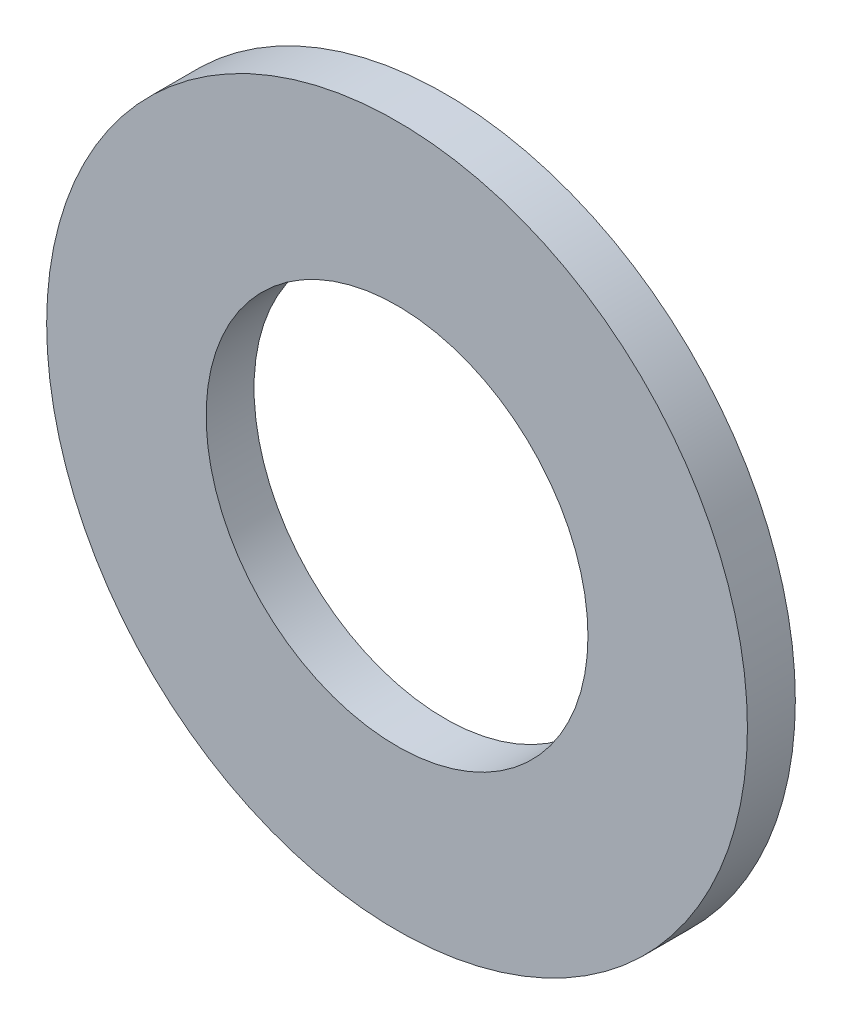
ISO-10303-21;
HEADER;
FILE_DESCRIPTION(('STEP AP214'),'2;1');
FILE_NAME('part.step','',(''),(''),'','','');
FILE_SCHEMA(('AUTOMOTIVE_DESIGN { 1 0 10303 214 1 1 1 1 }'));
ENDSEC;
DATA;
#1=APPLICATION_CONTEXT('core data for automotive mechanical design processes');
#2=APPLICATION_PROTOCOL_DEFINITION('international standard','automotive_design',2000,#1);
#3=PRODUCT_CONTEXT('',#1,'mechanical');
#4=PRODUCT('Part','Part','',(#3));
#5=PRODUCT_RELATED_PRODUCT_CATEGORY('part','',(#4));
#6=PRODUCT_DEFINITION_FORMATION('','',#4);
#7=PRODUCT_DEFINITION_CONTEXT('part definition',#1,'design');
#8=PRODUCT_DEFINITION('design','',#6,#7);
#9=PRODUCT_DEFINITION_SHAPE('','',#8);
#10=(LENGTH_UNIT() NAMED_UNIT(*) SI_UNIT(.MILLI.,.METRE.));
#11=(NAMED_UNIT(*) PLANE_ANGLE_UNIT() SI_UNIT($,.RADIAN.));
#12=(NAMED_UNIT(*) SI_UNIT($,.STERADIAN.) SOLID_ANGLE_UNIT());
#13=UNCERTAINTY_MEASURE_WITH_UNIT(LENGTH_MEASURE(1.E-05),#10,'distance_accuracy_value','');
#14=(GEOMETRIC_REPRESENTATION_CONTEXT(3) GLOBAL_UNCERTAINTY_ASSIGNED_CONTEXT((#13)) GLOBAL_UNIT_ASSIGNED_CONTEXT((#10,
#11,#12)) REPRESENTATION_CONTEXT('',''));
#15=CARTESIAN_POINT('',(0.,0.,0.));
#16=DIRECTION('',(0.,0.,1.));
#17=DIRECTION('',(1.,0.,0.));
#18=AXIS2_PLACEMENT_3D('',#15,#16,#17);
#19=CARTESIAN_POINT('',(0.,0.,0.4064));
#20=DIRECTION('',(0.,0.,1.));
#21=DIRECTION('',(1.,0.,0.));
#22=AXIS2_PLACEMENT_3D('',#19,#20,#21);
#23=PLANE('',#22);
#24=CARTESIAN_POINT('',(0.,0.,0.4064));
#25=DIRECTION('',(0.,0.,1.));
#26=DIRECTION('',(1.,0.,0.));
#27=AXIS2_PLACEMENT_3D('',#24,#25,#26);
#28=CIRCLE('',#27,5.9436);
#29=CARTESIAN_POINT('',(5.9436,0.,0.4064));
#30=VERTEX_POINT('',#29);
#31=EDGE_CURVE('E10',#30,#30,#28,.T.);
#32=ORIENTED_EDGE('',*,*,#31,.T.);
#33=EDGE_LOOP('',(#32));
#34=FACE_BOUND('',#33,.T.);
#35=CARTESIAN_POINT('',(0.,0.,0.4064));
#36=DIRECTION('',(0.,0.,1.));
#37=DIRECTION('',(1.,0.,0.));
#38=AXIS2_PLACEMENT_3D('',#35,#36,#37);
#39=CIRCLE('',#38,3.2385);
#40=CARTESIAN_POINT('',(3.2385,0.,0.4064));
#41=VERTEX_POINT('',#40);
#42=EDGE_CURVE('E48',#41,#41,#39,.T.);
#43=ORIENTED_EDGE('',*,*,#42,.F.);
#44=EDGE_LOOP('',(#43));
#45=FACE_BOUND('',#44,.T.);
#46=ADVANCED_FACE('F37',(#34,#45),#23,.T.);
#47=CARTESIAN_POINT('',(0.,0.,-0.4064));
#48=DIRECTION('',(0.,0.,1.));
#49=DIRECTION('',(1.,0.,0.));
#50=AXIS2_PLACEMENT_3D('',#47,#48,#49);
#51=PLANE('',#50);
#52=CARTESIAN_POINT('',(0.,0.,-0.4064));
#53=DIRECTION('',(0.,0.,1.));
#54=DIRECTION('',(1.,0.,0.));
#55=AXIS2_PLACEMENT_3D('',#52,#53,#54);
#56=CIRCLE('',#55,5.9436);
#57=CARTESIAN_POINT('',(5.9436,0.,-0.4064));
#58=VERTEX_POINT('',#57);
#59=EDGE_CURVE('E41',#58,#58,#56,.T.);
#60=ORIENTED_EDGE('',*,*,#59,.F.);
#61=EDGE_LOOP('',(#60));
#62=FACE_BOUND('',#61,.T.);
#63=CARTESIAN_POINT('',(0.,0.,-0.4064));
#64=DIRECTION('',(0.,0.,1.));
#65=DIRECTION('',(1.,0.,0.));
#66=AXIS2_PLACEMENT_3D('',#63,#64,#65);
#67=CIRCLE('',#66,3.2385);
#68=CARTESIAN_POINT('',(3.2385,0.,-0.4064));
#69=VERTEX_POINT('',#68);
#70=EDGE_CURVE('E50',#69,#69,#67,.T.);
#71=ORIENTED_EDGE('',*,*,#70,.T.);
#72=EDGE_LOOP('',(#71));
#73=FACE_BOUND('',#72,.T.);
#74=ADVANCED_FACE('F60',(#62,#73),#51,.F.);
#75=CARTESIAN_POINT('',(0.,0.,0.4064));
#76=DIRECTION('',(0.,0.,-1.));
#77=DIRECTION('',(-1.,0.,0.));
#78=AXIS2_PLACEMENT_3D('',#75,#76,#77);
#79=CYLINDRICAL_SURFACE('',#78,5.9436);
#80=ORIENTED_EDGE('',*,*,#31,.F.);
#81=EDGE_LOOP('',(#80));
#82=FACE_BOUND('',#81,.T.);
#83=ORIENTED_EDGE('',*,*,#59,.T.);
#84=EDGE_LOOP('',(#83));
#85=FACE_BOUND('',#84,.T.);
#86=ADVANCED_FACE('F39',(#82,#85),#79,.T.);
#87=CARTESIAN_POINT('',(0.,0.,0.4064));
#88=DIRECTION('',(0.,0.,-1.));
#89=DIRECTION('',(-1.,0.,0.));
#90=AXIS2_PLACEMENT_3D('',#87,#88,#89);
#91=CYLINDRICAL_SURFACE('',#90,3.2385);
#92=ORIENTED_EDGE('',*,*,#42,.T.);
#93=EDGE_LOOP('',(#92));
#94=FACE_BOUND('',#93,.T.);
#95=ORIENTED_EDGE('',*,*,#70,.F.);
#96=EDGE_LOOP('',(#95));
#97=FACE_BOUND('',#96,.T.);
#98=ADVANCED_FACE('F56',(#94,#97),#91,.F.);
#99=CLOSED_SHELL('',(#46,#74,#86,#98));
#100=MANIFOLD_SOLID_BREP('B2',#99);
#101=ADVANCED_BREP_SHAPE_REPRESENTATION('',(#18,#100),#14);
#102=SHAPE_DEFINITION_REPRESENTATION(#9,#101);
ENDSEC;
END-ISO-10303-21;
